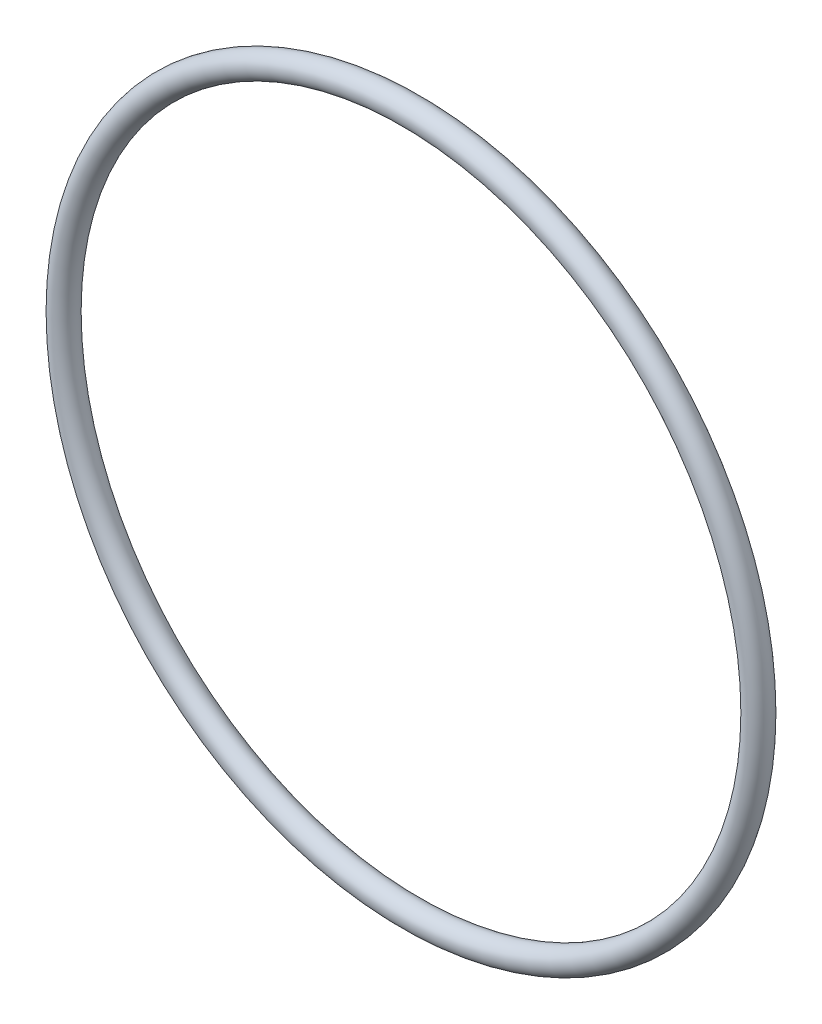
ISO-10303-21;
HEADER;
FILE_DESCRIPTION(('STEP AP214'),'2;1');
FILE_NAME('part.step','',(''),(''),'','','');
FILE_SCHEMA(('AUTOMOTIVE_DESIGN { 1 0 10303 214 1 1 1 1 }'));
ENDSEC;
DATA;
#1=APPLICATION_CONTEXT('core data for automotive mechanical design processes');
#2=APPLICATION_PROTOCOL_DEFINITION('international standard','automotive_design',2000,#1);
#3=PRODUCT_CONTEXT('',#1,'mechanical');
#4=PRODUCT('Part','Part','',(#3));
#5=PRODUCT_RELATED_PRODUCT_CATEGORY('part','',(#4));
#6=PRODUCT_DEFINITION_FORMATION('','',#4);
#7=PRODUCT_DEFINITION_CONTEXT('part definition',#1,'design');
#8=PRODUCT_DEFINITION('design','',#6,#7);
#9=PRODUCT_DEFINITION_SHAPE('','',#8);
#10=(LENGTH_UNIT() NAMED_UNIT(*) SI_UNIT(.MILLI.,.METRE.));
#11=(NAMED_UNIT(*) PLANE_ANGLE_UNIT() SI_UNIT($,.RADIAN.));
#12=(NAMED_UNIT(*) SI_UNIT($,.STERADIAN.) SOLID_ANGLE_UNIT());
#13=UNCERTAINTY_MEASURE_WITH_UNIT(LENGTH_MEASURE(1.E-05),#10,'distance_accuracy_value','');
#14=(GEOMETRIC_REPRESENTATION_CONTEXT(3) GLOBAL_UNCERTAINTY_ASSIGNED_CONTEXT((#13)) GLOBAL_UNIT_ASSIGNED_CONTEXT((#10,
#11,#12)) REPRESENTATION_CONTEXT('',''));
#15=CARTESIAN_POINT('',(0.,0.,0.));
#16=DIRECTION('',(0.,0.,1.));
#17=DIRECTION('',(1.,0.,0.));
#18=AXIS2_PLACEMENT_3D('',#15,#16,#17);
#19=CARTESIAN_POINT('',(0.,0.,1.1));
#20=DIRECTION('',(0.,0.,-1.));
#21=DIRECTION('',(-1.,0.,0.));
#22=AXIS2_PLACEMENT_3D('',#19,#20,#21);
#23=TOROIDAL_SURFACE('',#22,1.4,0.0499999999999999);
#24=CARTESIAN_POINT('',(-1.45,0.,1.1));
#25=VERTEX_POINT('',#24);
#26=VERTEX_LOOP('',#25);
#27=FACE_BOUND('',#26,.T.);
#28=ADVANCED_FACE('F13',(#27),#23,.T.);
#29=CLOSED_SHELL('',(#28));
#30=MANIFOLD_SOLID_BREP('B1',#29);
#31=ADVANCED_BREP_SHAPE_REPRESENTATION('',(#18,#30),#14);
#32=SHAPE_DEFINITION_REPRESENTATION(#9,#31);
ENDSEC;
END-ISO-10303-21;
